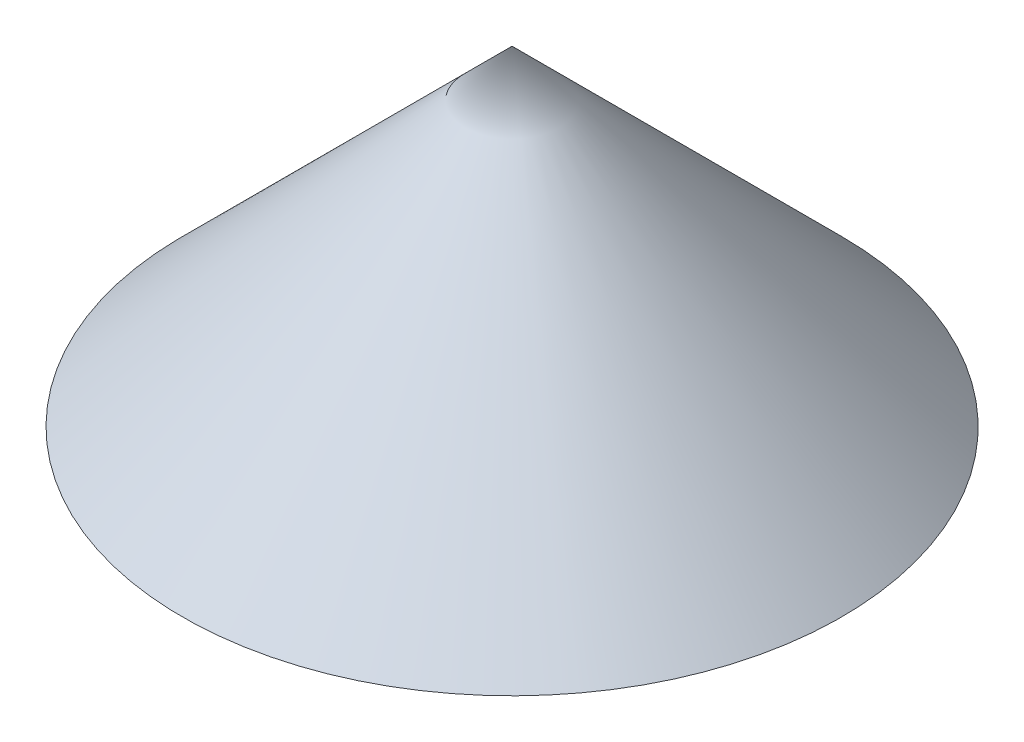
ISO-10303-21;
HEADER;
FILE_DESCRIPTION(('STEP AP214'),'2;1');
FILE_NAME('part.step','',(''),(''),'','','');
FILE_SCHEMA(('AUTOMOTIVE_DESIGN { 1 0 10303 214 1 1 1 1 }'));
ENDSEC;
DATA;
#1=APPLICATION_CONTEXT('core data for automotive mechanical design processes');
#2=APPLICATION_PROTOCOL_DEFINITION('international standard','automotive_design',2000,#1);
#3=PRODUCT_CONTEXT('',#1,'mechanical');
#4=PRODUCT('Part','Part','',(#3));
#5=PRODUCT_RELATED_PRODUCT_CATEGORY('part','',(#4));
#6=PRODUCT_DEFINITION_FORMATION('','',#4);
#7=PRODUCT_DEFINITION_CONTEXT('part definition',#1,'design');
#8=PRODUCT_DEFINITION('design','',#6,#7);
#9=PRODUCT_DEFINITION_SHAPE('','',#8);
#10=(LENGTH_UNIT() NAMED_UNIT(*) SI_UNIT(.MILLI.,.METRE.));
#11=(NAMED_UNIT(*) PLANE_ANGLE_UNIT() SI_UNIT($,.RADIAN.));
#12=(NAMED_UNIT(*) SI_UNIT($,.STERADIAN.) SOLID_ANGLE_UNIT());
#13=UNCERTAINTY_MEASURE_WITH_UNIT(LENGTH_MEASURE(1.E-05),#10,'distance_accuracy_value','');
#14=(GEOMETRIC_REPRESENTATION_CONTEXT(3) GLOBAL_UNCERTAINTY_ASSIGNED_CONTEXT((#13)) GLOBAL_UNIT_ASSIGNED_CONTEXT((#10,
#11,#12)) REPRESENTATION_CONTEXT('',''));
#15=CARTESIAN_POINT('',(0.,0.,0.));
#16=DIRECTION('',(0.,0.,1.));
#17=DIRECTION('',(1.,0.,0.));
#18=AXIS2_PLACEMENT_3D('',#15,#16,#17);
#19=CARTESIAN_POINT('',(9.9999999999999,0.,0.));
#20=DIRECTION('',(0.,-1.,0.));
#21=DIRECTION('',(0.,0.,-1.));
#22=AXIS2_PLACEMENT_3D('',#19,#20,#21);
#23=PLANE('',#22);
#24=CARTESIAN_POINT('',(0.,0.,0.));
#25=DIRECTION('',(0.,-1.,0.));
#26=DIRECTION('',(0.,0.,-1.));
#27=AXIS2_PLACEMENT_3D('',#24,#25,#26);
#28=CIRCLE('',#27,9.9999999999999);
#29=CARTESIAN_POINT('',(0.,0.,-9.9999999999999));
#30=VERTEX_POINT('',#29);
#31=EDGE_CURVE('E11',#30,#30,#28,.T.);
#32=ORIENTED_EDGE('',*,*,#31,.T.);
#33=EDGE_LOOP('',(#32));
#34=FACE_BOUND('',#33,.T.);
#35=ADVANCED_FACE('F33',(#34),#23,.T.);
#36=CARTESIAN_POINT('',(0.,0.,0.));
#37=DIRECTION('',(0.,-1.,0.));
#38=DIRECTION('',(0.,0.,-1.));
#39=AXIS2_PLACEMENT_3D('',#36,#37,#38);
#40=CONICAL_SURFACE('',#39,9.9999999999999,0.785398163397443);
#41=CARTESIAN_POINT('',(0.,10.,0.));
#42=VERTEX_POINT('',#41);
#43=VERTEX_LOOP('',#42);
#44=FACE_BOUND('',#43,.T.);
#45=ORIENTED_EDGE('',*,*,#31,.F.);
#46=EDGE_LOOP('',(#45));
#47=FACE_BOUND('',#46,.T.);
#48=ADVANCED_FACE('F40',(#44,#47),#40,.T.);
#49=CLOSED_SHELL('',(#35,#48));
#50=MANIFOLD_SOLID_BREP('B2',#49);
#51=ADVANCED_BREP_SHAPE_REPRESENTATION('',(#18,#50),#14);
#52=SHAPE_DEFINITION_REPRESENTATION(#9,#51);
ENDSEC;
END-ISO-10303-21;
